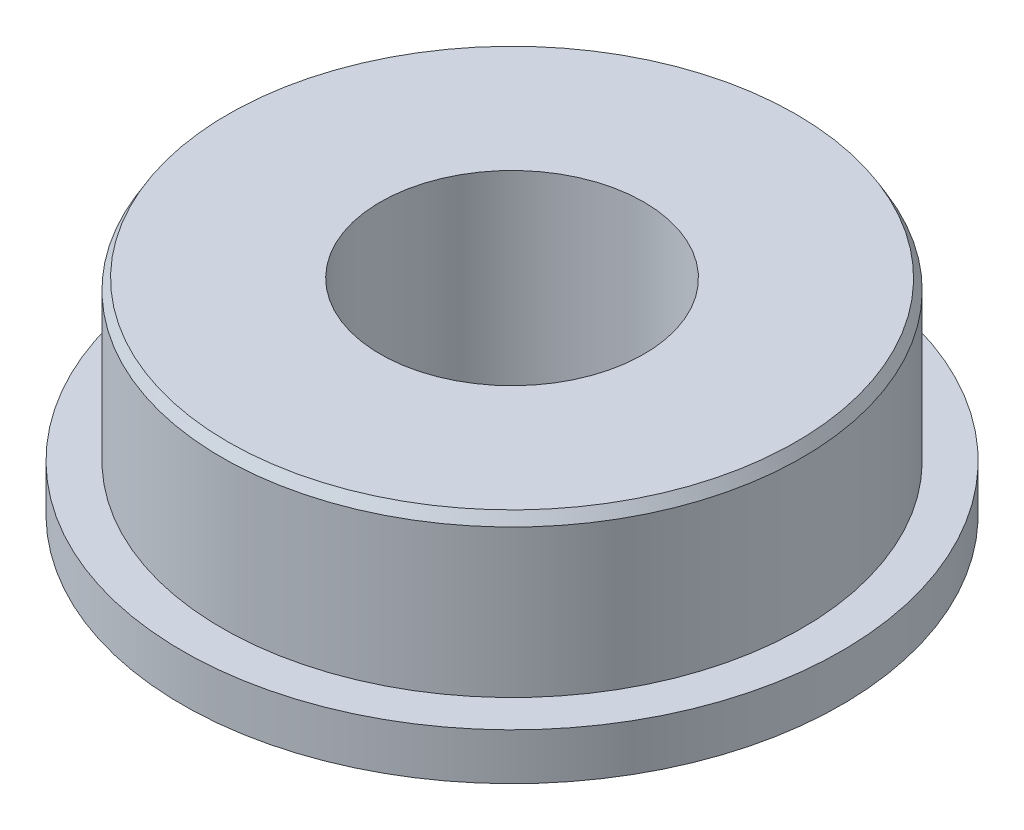
ISO-10303-21;
HEADER;
FILE_DESCRIPTION(('STEP AP214'),'2;1');
FILE_NAME('part.step','',(''),(''),'','','');
FILE_SCHEMA(('AUTOMOTIVE_DESIGN { 1 0 10303 214 1 1 1 1 }'));
ENDSEC;
DATA;
#1=APPLICATION_CONTEXT('core data for automotive mechanical design processes');
#2=APPLICATION_PROTOCOL_DEFINITION('international standard','automotive_design',2000,#1);
#3=PRODUCT_CONTEXT('',#1,'mechanical');
#4=PRODUCT('Part','Part','',(#3));
#5=PRODUCT_RELATED_PRODUCT_CATEGORY('part','',(#4));
#6=PRODUCT_DEFINITION_FORMATION('','',#4);
#7=PRODUCT_DEFINITION_CONTEXT('part definition',#1,'design');
#8=PRODUCT_DEFINITION('design','',#6,#7);
#9=PRODUCT_DEFINITION_SHAPE('','',#8);
#10=(LENGTH_UNIT() NAMED_UNIT(*) SI_UNIT(.MILLI.,.METRE.));
#11=(NAMED_UNIT(*) PLANE_ANGLE_UNIT() SI_UNIT($,.RADIAN.));
#12=(NAMED_UNIT(*) SI_UNIT($,.STERADIAN.) SOLID_ANGLE_UNIT());
#13=UNCERTAINTY_MEASURE_WITH_UNIT(LENGTH_MEASURE(1.E-05),#10,'distance_accuracy_value','');
#14=(GEOMETRIC_REPRESENTATION_CONTEXT(3) GLOBAL_UNCERTAINTY_ASSIGNED_CONTEXT((#13)) GLOBAL_UNIT_ASSIGNED_CONTEXT((#10,
#11,#12)) REPRESENTATION_CONTEXT('',''));
#15=CARTESIAN_POINT('',(0.,0.,0.));
#16=DIRECTION('',(0.,0.,1.));
#17=DIRECTION('',(1.,0.,0.));
#18=AXIS2_PLACEMENT_3D('',#15,#16,#17);
#19=CARTESIAN_POINT('',(0.,4.,0.));
#20=DIRECTION('',(0.,-1.,0.));
#21=DIRECTION('',(0.,0.,1.));
#22=AXIS2_PLACEMENT_3D('',#19,#20,#21);
#23=CYLINDRICAL_SURFACE('',#22,2.5);
#24=CARTESIAN_POINT('',(0.,4.,0.));
#25=DIRECTION('',(0.,-1.,0.));
#26=DIRECTION('',(0.,0.,-1.));
#27=AXIS2_PLACEMENT_3D('',#24,#25,#26);
#28=CIRCLE('',#27,2.5);
#29=CARTESIAN_POINT('',(0.,4.,-2.5));
#30=VERTEX_POINT('',#29);
#31=EDGE_CURVE('E57',#30,#30,#28,.T.);
#32=ORIENTED_EDGE('',*,*,#31,.F.);
#33=EDGE_LOOP('',(#32));
#34=FACE_BOUND('',#33,.T.);
#35=CARTESIAN_POINT('',(0.,0.,0.));
#36=DIRECTION('',(0.,-1.,0.));
#37=DIRECTION('',(0.,0.,-1.));
#38=AXIS2_PLACEMENT_3D('',#35,#36,#37);
#39=CIRCLE('',#38,2.5);
#40=CARTESIAN_POINT('',(0.,0.,-2.5));
#41=VERTEX_POINT('',#40);
#42=EDGE_CURVE('E58',#41,#41,#39,.T.);
#43=ORIENTED_EDGE('',*,*,#42,.T.);
#44=EDGE_LOOP('',(#43));
#45=FACE_BOUND('',#44,.T.);
#46=ADVANCED_FACE('F37',(#34,#45),#23,.F.);
#47=CARTESIAN_POINT('',(0.,4.,0.));
#48=DIRECTION('',(0.,-1.,0.));
#49=DIRECTION('',(0.,0.,1.));
#50=AXIS2_PLACEMENT_3D('',#47,#48,#49);
#51=CYLINDRICAL_SURFACE('',#50,5.5);
#52=CARTESIAN_POINT('',(0.,3.79999999999999,0.));
#53=DIRECTION('',(0.,-1.,0.));
#54=DIRECTION('',(0.,0.,-1.));
#55=AXIS2_PLACEMENT_3D('',#52,#53,#54);
#56=CIRCLE('',#55,5.5);
#57=CARTESIAN_POINT('',(0.,3.79999999999999,-5.5));
#58=VERTEX_POINT('',#57);
#59=EDGE_CURVE('E10',#58,#58,#56,.F.);
#60=ORIENTED_EDGE('',*,*,#59,.F.);
#61=EDGE_LOOP('',(#60));
#62=FACE_BOUND('',#61,.T.);
#63=CARTESIAN_POINT('',(0.,1.,0.));
#64=DIRECTION('',(0.,-1.,0.));
#65=DIRECTION('',(0.,0.,-1.));
#66=AXIS2_PLACEMENT_3D('',#63,#64,#65);
#67=CIRCLE('',#66,5.5);
#68=CARTESIAN_POINT('',(0.,1.,-5.5));
#69=VERTEX_POINT('',#68);
#70=EDGE_CURVE('E66',#69,#69,#67,.T.);
#71=ORIENTED_EDGE('',*,*,#70,.F.);
#72=EDGE_LOOP('',(#71));
#73=FACE_BOUND('',#72,.T.);
#74=ADVANCED_FACE('F73',(#62,#73),#51,.T.);
#75=CARTESIAN_POINT('',(0.,4.,0.));
#76=DIRECTION('',(0.,1.,0.));
#77=DIRECTION('',(0.,0.,-1.));
#78=AXIS2_PLACEMENT_3D('',#75,#76,#77);
#79=PLANE('',#78);
#80=CARTESIAN_POINT('',(0.,4.,0.));
#81=DIRECTION('',(0.,-1.,0.));
#82=DIRECTION('',(0.,0.,-1.));
#83=AXIS2_PLACEMENT_3D('',#80,#81,#82);
#84=CIRCLE('',#83,5.38452994616207);
#85=CARTESIAN_POINT('',(0.,4.,-5.38452994616207));
#86=VERTEX_POINT('',#85);
#87=EDGE_CURVE('E44',#86,#86,#84,.T.);
#88=ORIENTED_EDGE('',*,*,#87,.F.);
#89=EDGE_LOOP('',(#88));
#90=FACE_BOUND('',#89,.T.);
#91=ORIENTED_EDGE('',*,*,#31,.T.);
#92=EDGE_LOOP('',(#91));
#93=FACE_BOUND('',#92,.T.);
#94=ADVANCED_FACE('F75',(#90,#93),#79,.T.);
#95=CARTESIAN_POINT('',(0.,0.,0.));
#96=DIRECTION('',(0.,1.,0.));
#97=DIRECTION('',(0.,0.,-1.));
#98=AXIS2_PLACEMENT_3D('',#95,#96,#97);
#99=PLANE('',#98);
#100=CARTESIAN_POINT('',(0.,0.,0.));
#101=DIRECTION('',(0.,-1.,0.));
#102=DIRECTION('',(0.,0.,-1.));
#103=AXIS2_PLACEMENT_3D('',#100,#101,#102);
#104=CIRCLE('',#103,6.05);
#105=CARTESIAN_POINT('',(0.,0.,-6.05));
#106=VERTEX_POINT('',#105);
#107=EDGE_CURVE('E48',#106,#106,#104,.F.);
#108=ORIENTED_EDGE('',*,*,#107,.F.);
#109=EDGE_LOOP('',(#108));
#110=FACE_BOUND('',#109,.T.);
#111=ORIENTED_EDGE('',*,*,#42,.F.);
#112=EDGE_LOOP('',(#111));
#113=FACE_BOUND('',#112,.T.);
#114=ADVANCED_FACE('F82',(#110,#113),#99,.F.);
#115=CARTESIAN_POINT('',(0.,1.,0.));
#116=DIRECTION('',(0.,-1.,0.));
#117=DIRECTION('',(0.,0.,1.));
#118=AXIS2_PLACEMENT_3D('',#115,#116,#117);
#119=CYLINDRICAL_SURFACE('',#118,6.25);
#120=CARTESIAN_POINT('',(0.,0.115470053837927,0.));
#121=DIRECTION('',(0.,-1.,0.));
#122=DIRECTION('',(0.,0.,-1.));
#123=AXIS2_PLACEMENT_3D('',#120,#121,#122);
#124=CIRCLE('',#123,6.25);
#125=CARTESIAN_POINT('',(0.,0.115470053837927,-6.25));
#126=VERTEX_POINT('',#125);
#127=EDGE_CURVE('E52',#126,#126,#124,.T.);
#128=ORIENTED_EDGE('',*,*,#127,.F.);
#129=EDGE_LOOP('',(#128));
#130=FACE_BOUND('',#129,.T.);
#131=CARTESIAN_POINT('',(0.,1.,0.));
#132=DIRECTION('',(0.,-1.,0.));
#133=DIRECTION('',(0.,0.,-1.));
#134=AXIS2_PLACEMENT_3D('',#131,#132,#133);
#135=CIRCLE('',#134,6.25);
#136=CARTESIAN_POINT('',(0.,1.,-6.25));
#137=VERTEX_POINT('',#136);
#138=EDGE_CURVE('E61',#137,#137,#135,.T.);
#139=ORIENTED_EDGE('',*,*,#138,.T.);
#140=EDGE_LOOP('',(#139));
#141=FACE_BOUND('',#140,.T.);
#142=ADVANCED_FACE('F95',(#130,#141),#119,.T.);
#143=CARTESIAN_POINT('',(0.,1.,0.));
#144=DIRECTION('',(0.,1.,0.));
#145=DIRECTION('',(0.,0.,-1.));
#146=AXIS2_PLACEMENT_3D('',#143,#144,#145);
#147=PLANE('',#146);
#148=ORIENTED_EDGE('',*,*,#70,.T.);
#149=EDGE_LOOP('',(#148));
#150=FACE_BOUND('',#149,.T.);
#151=ORIENTED_EDGE('',*,*,#138,.F.);
#152=EDGE_LOOP('',(#151));
#153=FACE_BOUND('',#152,.T.);
#154=ADVANCED_FACE('F70',(#150,#153),#147,.T.);
#155=CARTESIAN_POINT('',(0.,0.115470053837927,0.));
#156=DIRECTION('',(0.,1.,0.));
#157=DIRECTION('',(0.,0.,-1.));
#158=AXIS2_PLACEMENT_3D('',#155,#156,#157);
#159=CONICAL_SURFACE('',#158,6.25,1.0471975511966);
#160=ORIENTED_EDGE('',*,*,#107,.T.);
#161=EDGE_LOOP('',(#160));
#162=FACE_BOUND('',#161,.T.);
#163=ORIENTED_EDGE('',*,*,#127,.T.);
#164=EDGE_LOOP('',(#163));
#165=FACE_BOUND('',#164,.T.);
#166=ADVANCED_FACE('F88',(#162,#165),#159,.T.);
#167=CARTESIAN_POINT('',(0.,4.,0.));
#168=DIRECTION('',(0.,-1.,0.));
#169=DIRECTION('',(0.,0.,1.));
#170=AXIS2_PLACEMENT_3D('',#167,#168,#169);
#171=CONICAL_SURFACE('',#170,5.38452994616207,0.523598775598298);
#172=ORIENTED_EDGE('',*,*,#59,.T.);
#173=EDGE_LOOP('',(#172));
#174=FACE_BOUND('',#173,.T.);
#175=ORIENTED_EDGE('',*,*,#87,.T.);
#176=EDGE_LOOP('',(#175));
#177=FACE_BOUND('',#176,.T.);
#178=ADVANCED_FACE('F39',(#174,#177),#171,.T.);
#179=CLOSED_SHELL('',(#46,#74,#94,#114,#142,#154,#166,#178));
#180=MANIFOLD_SOLID_BREP('B2',#179);
#181=ADVANCED_BREP_SHAPE_REPRESENTATION('',(#18,#180),#14);
#182=SHAPE_DEFINITION_REPRESENTATION(#9,#181);
ENDSEC;
END-ISO-10303-21;
